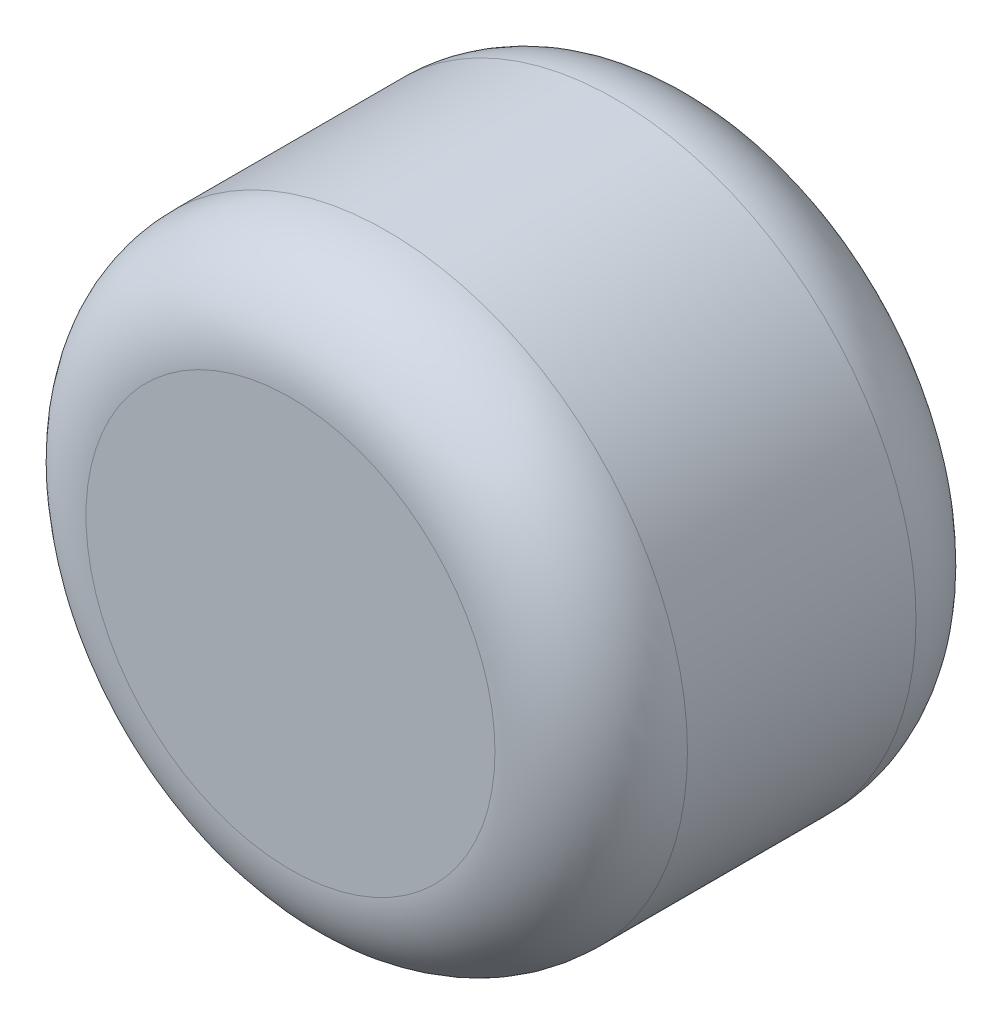
ISO-10303-21;
HEADER;
FILE_DESCRIPTION(('STEP AP214'),'2;1');
FILE_NAME('part.step','',(''),(''),'','','');
FILE_SCHEMA(('AUTOMOTIVE_DESIGN { 1 0 10303 214 1 1 1 1 }'));
ENDSEC;
DATA;
#1=APPLICATION_CONTEXT('core data for automotive mechanical design processes');
#2=APPLICATION_PROTOCOL_DEFINITION('international standard','automotive_design',2000,#1);
#3=PRODUCT_CONTEXT('',#1,'mechanical');
#4=PRODUCT('Part','Part','',(#3));
#5=PRODUCT_RELATED_PRODUCT_CATEGORY('part','',(#4));
#6=PRODUCT_DEFINITION_FORMATION('','',#4);
#7=PRODUCT_DEFINITION_CONTEXT('part definition',#1,'design');
#8=PRODUCT_DEFINITION('design','',#6,#7);
#9=PRODUCT_DEFINITION_SHAPE('','',#8);
#10=(LENGTH_UNIT() NAMED_UNIT(*) SI_UNIT(.MILLI.,.METRE.));
#11=(NAMED_UNIT(*) PLANE_ANGLE_UNIT() SI_UNIT($,.RADIAN.));
#12=(NAMED_UNIT(*) SI_UNIT($,.STERADIAN.) SOLID_ANGLE_UNIT());
#13=UNCERTAINTY_MEASURE_WITH_UNIT(LENGTH_MEASURE(1.E-05),#10,'distance_accuracy_value','');
#14=(GEOMETRIC_REPRESENTATION_CONTEXT(3) GLOBAL_UNCERTAINTY_ASSIGNED_CONTEXT((#13)) GLOBAL_UNIT_ASSIGNED_CONTEXT((#10,
#11,#12)) REPRESENTATION_CONTEXT('',''));
#15=CARTESIAN_POINT('',(0.,0.,0.));
#16=DIRECTION('',(0.,0.,1.));
#17=DIRECTION('',(1.,0.,0.));
#18=AXIS2_PLACEMENT_3D('',#15,#16,#17);
#19=CARTESIAN_POINT('',(0.,0.,44.45));
#20=DIRECTION('',(0.,0.,-1.));
#21=DIRECTION('',(-1.,0.,0.));
#22=AXIS2_PLACEMENT_3D('',#19,#20,#21);
#23=CYLINDRICAL_SURFACE('',#22,63.5);
#24=CARTESIAN_POINT('',(0.,0.,-24.13));
#25=DIRECTION('',(0.,0.,1.));
#26=DIRECTION('',(1.,0.,0.));
#27=AXIS2_PLACEMENT_3D('',#24,#25,#26);
#28=CIRCLE('',#27,63.5);
#29=CARTESIAN_POINT('',(63.5,0.,-24.13));
#30=VERTEX_POINT('',#29);
#31=EDGE_CURVE('E43',#30,#30,#28,.T.);
#32=ORIENTED_EDGE('',*,*,#31,.T.);
#33=EDGE_LOOP('',(#32));
#34=FACE_BOUND('',#33,.T.);
#35=CARTESIAN_POINT('',(0.,0.,24.13));
#36=DIRECTION('',(0.,0.,1.));
#37=DIRECTION('',(1.,0.,0.));
#38=AXIS2_PLACEMENT_3D('',#35,#36,#37);
#39=CIRCLE('',#38,63.5);
#40=CARTESIAN_POINT('',(63.5,0.,24.13));
#41=VERTEX_POINT('',#40);
#42=EDGE_CURVE('E47',#41,#41,#39,.F.);
#43=ORIENTED_EDGE('',*,*,#42,.T.);
#44=EDGE_LOOP('',(#43));
#45=FACE_BOUND('',#44,.T.);
#46=ADVANCED_FACE('F32',(#34,#45),#23,.T.);
#47=CARTESIAN_POINT('',(0.,0.,44.45));
#48=DIRECTION('',(0.,0.,1.));
#49=DIRECTION('',(1.,0.,0.));
#50=AXIS2_PLACEMENT_3D('',#47,#48,#49);
#51=PLANE('',#50);
#52=CARTESIAN_POINT('',(0.,0.,44.45));
#53=DIRECTION('',(0.,0.,1.));
#54=DIRECTION('',(1.,0.,0.));
#55=AXIS2_PLACEMENT_3D('',#52,#53,#54);
#56=CIRCLE('',#55,43.18);
#57=CARTESIAN_POINT('',(43.18,0.,44.45));
#58=VERTEX_POINT('',#57);
#59=EDGE_CURVE('E10',#58,#58,#56,.T.);
#60=ORIENTED_EDGE('',*,*,#59,.T.);
#61=EDGE_LOOP('',(#60));
#62=FACE_BOUND('',#61,.T.);
#63=ADVANCED_FACE('F63',(#62),#51,.T.);
#64=CARTESIAN_POINT('',(0.,0.,-44.45));
#65=DIRECTION('',(0.,0.,1.));
#66=DIRECTION('',(1.,0.,0.));
#67=AXIS2_PLACEMENT_3D('',#64,#65,#66);
#68=PLANE('',#67);
#69=CARTESIAN_POINT('',(0.,0.,-44.45));
#70=DIRECTION('',(0.,0.,1.));
#71=DIRECTION('',(1.,0.,0.));
#72=AXIS2_PLACEMENT_3D('',#69,#70,#71);
#73=CIRCLE('',#72,43.18);
#74=CARTESIAN_POINT('',(43.18,0.,-44.45));
#75=VERTEX_POINT('',#74);
#76=EDGE_CURVE('E39',#75,#75,#73,.F.);
#77=ORIENTED_EDGE('',*,*,#76,.T.);
#78=EDGE_LOOP('',(#77));
#79=FACE_BOUND('',#78,.T.);
#80=ADVANCED_FACE('F60',(#79),#68,.F.);
#81=CARTESIAN_POINT('',(0.,0.,-24.13));
#82=DIRECTION('',(0.,0.,1.));
#83=DIRECTION('',(1.,0.,0.));
#84=AXIS2_PLACEMENT_3D('',#81,#82,#83);
#85=TOROIDAL_SURFACE('',#84,43.18,20.32);
#86=ORIENTED_EDGE('',*,*,#76,.F.);
#87=EDGE_LOOP('',(#86));
#88=FACE_BOUND('',#87,.T.);
#89=ORIENTED_EDGE('',*,*,#31,.F.);
#90=EDGE_LOOP('',(#89));
#91=FACE_BOUND('',#90,.T.);
#92=ADVANCED_FACE('F56',(#88,#91),#85,.T.);
#93=CARTESIAN_POINT('',(0.,0.,24.13));
#94=DIRECTION('',(0.,0.,1.));
#95=DIRECTION('',(1.,0.,0.));
#96=AXIS2_PLACEMENT_3D('',#93,#94,#95);
#97=TOROIDAL_SURFACE('',#96,43.18,20.32);
#98=ORIENTED_EDGE('',*,*,#42,.F.);
#99=EDGE_LOOP('',(#98));
#100=FACE_BOUND('',#99,.T.);
#101=ORIENTED_EDGE('',*,*,#59,.F.);
#102=EDGE_LOOP('',(#101));
#103=FACE_BOUND('',#102,.T.);
#104=ADVANCED_FACE('F34',(#100,#103),#97,.T.);
#105=CLOSED_SHELL('',(#46,#63,#80,#92,#104));
#106=MANIFOLD_SOLID_BREP('B2',#105);
#107=ADVANCED_BREP_SHAPE_REPRESENTATION('',(#18,#106),#14);
#108=SHAPE_DEFINITION_REPRESENTATION(#9,#107);
ENDSEC;
END-ISO-10303-21;
